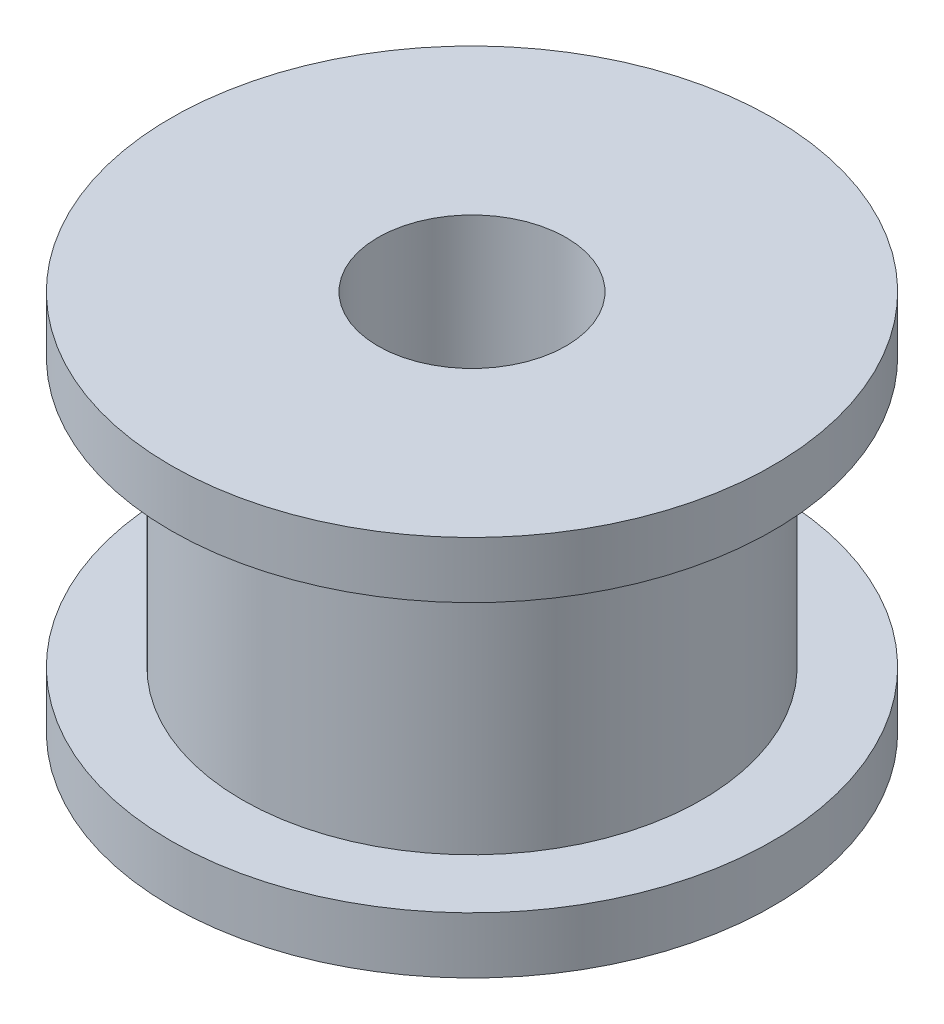
ISO-10303-21;
HEADER;
FILE_DESCRIPTION(('STEP AP214'),'2;1');
FILE_NAME('part.step','',(''),(''),'','','');
FILE_SCHEMA(('AUTOMOTIVE_DESIGN { 1 0 10303 214 1 1 1 1 }'));
ENDSEC;
DATA;
#1=APPLICATION_CONTEXT('core data for automotive mechanical design processes');
#2=APPLICATION_PROTOCOL_DEFINITION('international standard','automotive_design',2000,#1);
#3=PRODUCT_CONTEXT('',#1,'mechanical');
#4=PRODUCT('Part','Part','',(#3));
#5=PRODUCT_RELATED_PRODUCT_CATEGORY('part','',(#4));
#6=PRODUCT_DEFINITION_FORMATION('','',#4);
#7=PRODUCT_DEFINITION_CONTEXT('part definition',#1,'design');
#8=PRODUCT_DEFINITION('design','',#6,#7);
#9=PRODUCT_DEFINITION_SHAPE('','',#8);
#10=(LENGTH_UNIT() NAMED_UNIT(*) SI_UNIT(.MILLI.,.METRE.));
#11=(NAMED_UNIT(*) PLANE_ANGLE_UNIT() SI_UNIT($,.RADIAN.));
#12=(NAMED_UNIT(*) SI_UNIT($,.STERADIAN.) SOLID_ANGLE_UNIT());
#13=UNCERTAINTY_MEASURE_WITH_UNIT(LENGTH_MEASURE(1.E-05),#10,'distance_accuracy_value','');
#14=(GEOMETRIC_REPRESENTATION_CONTEXT(3) GLOBAL_UNCERTAINTY_ASSIGNED_CONTEXT((#13)) GLOBAL_UNIT_ASSIGNED_CONTEXT((#10,
#11,#12)) REPRESENTATION_CONTEXT('',''));
#15=CARTESIAN_POINT('',(0.,0.,0.));
#16=DIRECTION('',(0.,0.,1.));
#17=DIRECTION('',(1.,0.,0.));
#18=AXIS2_PLACEMENT_3D('',#15,#16,#17);
#19=CARTESIAN_POINT('',(0.,7.1,0.));
#20=DIRECTION('',(0.,-1.,0.));
#21=DIRECTION('',(0.,0.,-1.));
#22=AXIS2_PLACEMENT_3D('',#19,#20,#21);
#23=CYLINDRICAL_SURFACE('',#22,8.);
#24=CARTESIAN_POINT('',(0.,7.1,0.));
#25=DIRECTION('',(0.,1.,0.));
#26=DIRECTION('',(0.,0.,1.));
#27=AXIS2_PLACEMENT_3D('',#24,#25,#26);
#28=CIRCLE('',#27,8.);
#29=CARTESIAN_POINT('',(0.,7.1,8.));
#30=VERTEX_POINT('',#29);
#31=EDGE_CURVE('E39',#30,#30,#28,.T.);
#32=ORIENTED_EDGE('',*,*,#31,.F.);
#33=EDGE_LOOP('',(#32));
#34=FACE_BOUND('',#33,.T.);
#35=CARTESIAN_POINT('',(0.,5.6,0.));
#36=DIRECTION('',(0.,-1.,0.));
#37=DIRECTION('',(0.,0.,-1.));
#38=AXIS2_PLACEMENT_3D('',#35,#36,#37);
#39=CIRCLE('',#38,8.);
#40=CARTESIAN_POINT('',(0.,5.6,-8.));
#41=VERTEX_POINT('',#40);
#42=EDGE_CURVE('E57',#41,#41,#39,.T.);
#43=ORIENTED_EDGE('',*,*,#42,.F.);
#44=EDGE_LOOP('',(#43));
#45=FACE_BOUND('',#44,.T.);
#46=ADVANCED_FACE('F32',(#34,#45),#23,.T.);
#47=CARTESIAN_POINT('',(0.,16.,0.));
#48=DIRECTION('',(0.,-1.,0.));
#49=DIRECTION('',(0.,0.,-1.));
#50=AXIS2_PLACEMENT_3D('',#47,#48,#49);
#51=CYLINDRICAL_SURFACE('',#50,2.5);
#52=CARTESIAN_POINT('',(0.,15.74,0.));
#53=DIRECTION('',(0.,1.,0.));
#54=DIRECTION('',(0.,0.,1.));
#55=AXIS2_PLACEMENT_3D('',#52,#53,#54);
#56=CIRCLE('',#55,2.5);
#57=CARTESIAN_POINT('',(0.,15.74,2.5));
#58=VERTEX_POINT('',#57);
#59=EDGE_CURVE('E52',#58,#58,#56,.T.);
#60=ORIENTED_EDGE('',*,*,#59,.T.);
#61=EDGE_LOOP('',(#60));
#62=FACE_BOUND('',#61,.T.);
#63=CARTESIAN_POINT('',(0.,5.6,0.));
#64=DIRECTION('',(0.,-1.,0.));
#65=DIRECTION('',(0.,0.,-1.));
#66=AXIS2_PLACEMENT_3D('',#63,#64,#65);
#67=CIRCLE('',#66,2.5);
#68=CARTESIAN_POINT('',(0.,5.6,-2.5));
#69=VERTEX_POINT('',#68);
#70=EDGE_CURVE('E35',#69,#69,#67,.F.);
#71=ORIENTED_EDGE('',*,*,#70,.F.);
#72=EDGE_LOOP('',(#71));
#73=FACE_BOUND('',#72,.T.);
#74=ADVANCED_FACE('F66',(#62,#73),#51,.F.);
#75=CARTESIAN_POINT('',(0.,7.1,0.));
#76=DIRECTION('',(0.,1.,0.));
#77=DIRECTION('',(0.,0.,1.));
#78=AXIS2_PLACEMENT_3D('',#75,#76,#77);
#79=PLANE('',#78);
#80=CARTESIAN_POINT('',(0.,7.1,0.));
#81=DIRECTION('',(0.,1.,0.));
#82=DIRECTION('',(0.,0.,1.));
#83=AXIS2_PLACEMENT_3D('',#80,#81,#82);
#84=CIRCLE('',#83,6.11);
#85=CARTESIAN_POINT('',(0.,7.1,6.11));
#86=VERTEX_POINT('',#85);
#87=EDGE_CURVE('E10',#86,#86,#84,.T.);
#88=ORIENTED_EDGE('',*,*,#87,.F.);
#89=EDGE_LOOP('',(#88));
#90=FACE_BOUND('',#89,.T.);
#91=ORIENTED_EDGE('',*,*,#31,.T.);
#92=EDGE_LOOP('',(#91));
#93=FACE_BOUND('',#92,.T.);
#94=ADVANCED_FACE('F68',(#90,#93),#79,.T.);
#95=CARTESIAN_POINT('',(0.,14.24,0.));
#96=DIRECTION('',(0.,-1.,0.));
#97=DIRECTION('',(0.,0.,-1.));
#98=AXIS2_PLACEMENT_3D('',#95,#96,#97);
#99=CYLINDRICAL_SURFACE('',#98,6.11);
#100=CARTESIAN_POINT('',(0.,14.24,0.));
#101=DIRECTION('',(0.,1.,0.));
#102=DIRECTION('',(0.,0.,1.));
#103=AXIS2_PLACEMENT_3D('',#100,#101,#102);
#104=CIRCLE('',#103,6.11);
#105=CARTESIAN_POINT('',(0.,14.24,6.11));
#106=VERTEX_POINT('',#105);
#107=EDGE_CURVE('E44',#106,#106,#104,.T.);
#108=ORIENTED_EDGE('',*,*,#107,.F.);
#109=EDGE_LOOP('',(#108));
#110=FACE_BOUND('',#109,.T.);
#111=ORIENTED_EDGE('',*,*,#87,.T.);
#112=EDGE_LOOP('',(#111));
#113=FACE_BOUND('',#112,.T.);
#114=ADVANCED_FACE('F75',(#110,#113),#99,.T.);
#115=CARTESIAN_POINT('',(0.,14.24,0.));
#116=DIRECTION('',(0.,1.,0.));
#117=DIRECTION('',(0.,0.,1.));
#118=AXIS2_PLACEMENT_3D('',#115,#116,#117);
#119=PLANE('',#118);
#120=ORIENTED_EDGE('',*,*,#107,.T.);
#121=EDGE_LOOP('',(#120));
#122=FACE_BOUND('',#121,.T.);
#123=CARTESIAN_POINT('',(0.,14.24,0.));
#124=DIRECTION('',(0.,1.,0.));
#125=DIRECTION('',(0.,0.,1.));
#126=AXIS2_PLACEMENT_3D('',#123,#124,#125);
#127=CIRCLE('',#126,8.);
#128=CARTESIAN_POINT('',(0.,14.24,8.));
#129=VERTEX_POINT('',#128);
#130=EDGE_CURVE('E49',#129,#129,#127,.T.);
#131=ORIENTED_EDGE('',*,*,#130,.F.);
#132=EDGE_LOOP('',(#131));
#133=FACE_BOUND('',#132,.T.);
#134=ADVANCED_FACE('F83',(#122,#133),#119,.F.);
#135=CARTESIAN_POINT('',(0.,15.74,0.));
#136=DIRECTION('',(0.,1.,0.));
#137=DIRECTION('',(0.,0.,1.));
#138=AXIS2_PLACEMENT_3D('',#135,#136,#137);
#139=PLANE('',#138);
#140=ORIENTED_EDGE('',*,*,#59,.F.);
#141=EDGE_LOOP('',(#140));
#142=FACE_BOUND('',#141,.T.);
#143=CARTESIAN_POINT('',(0.,15.74,0.));
#144=DIRECTION('',(0.,1.,0.));
#145=DIRECTION('',(0.,0.,1.));
#146=AXIS2_PLACEMENT_3D('',#143,#144,#145);
#147=CIRCLE('',#146,8.);
#148=CARTESIAN_POINT('',(0.,15.74,8.));
#149=VERTEX_POINT('',#148);
#150=EDGE_CURVE('E48',#149,#149,#147,.T.);
#151=ORIENTED_EDGE('',*,*,#150,.T.);
#152=EDGE_LOOP('',(#151));
#153=FACE_BOUND('',#152,.T.);
#154=ADVANCED_FACE('F88',(#142,#153),#139,.T.);
#155=CARTESIAN_POINT('',(0.,15.74,0.));
#156=DIRECTION('',(0.,-1.,0.));
#157=DIRECTION('',(0.,0.,-1.));
#158=AXIS2_PLACEMENT_3D('',#155,#156,#157);
#159=CYLINDRICAL_SURFACE('',#158,8.);
#160=ORIENTED_EDGE('',*,*,#150,.F.);
#161=EDGE_LOOP('',(#160));
#162=FACE_BOUND('',#161,.T.);
#163=ORIENTED_EDGE('',*,*,#130,.T.);
#164=EDGE_LOOP('',(#163));
#165=FACE_BOUND('',#164,.T.);
#166=ADVANCED_FACE('F80',(#162,#165),#159,.T.);
#167=CARTESIAN_POINT('',(10.,5.6,8.));
#168=DIRECTION('',(0.,-1.,0.));
#169=DIRECTION('',(0.,0.,-1.));
#170=AXIS2_PLACEMENT_3D('',#167,#168,#169);
#171=PLANE('',#170);
#172=ORIENTED_EDGE('',*,*,#70,.T.);
#173=EDGE_LOOP('',(#172));
#174=FACE_BOUND('',#173,.T.);
#175=ORIENTED_EDGE('',*,*,#42,.T.);
#176=EDGE_LOOP('',(#175));
#177=FACE_BOUND('',#176,.T.);
#178=ADVANCED_FACE('F64',(#174,#177),#171,.T.);
#179=CLOSED_SHELL('',(#46,#74,#94,#114,#134,#154,#166,#178));
#180=MANIFOLD_SOLID_BREP('B2',#179);
#181=ADVANCED_BREP_SHAPE_REPRESENTATION('',(#18,#180),#14);
#182=SHAPE_DEFINITION_REPRESENTATION(#9,#181);
ENDSEC;
END-ISO-10303-21;
